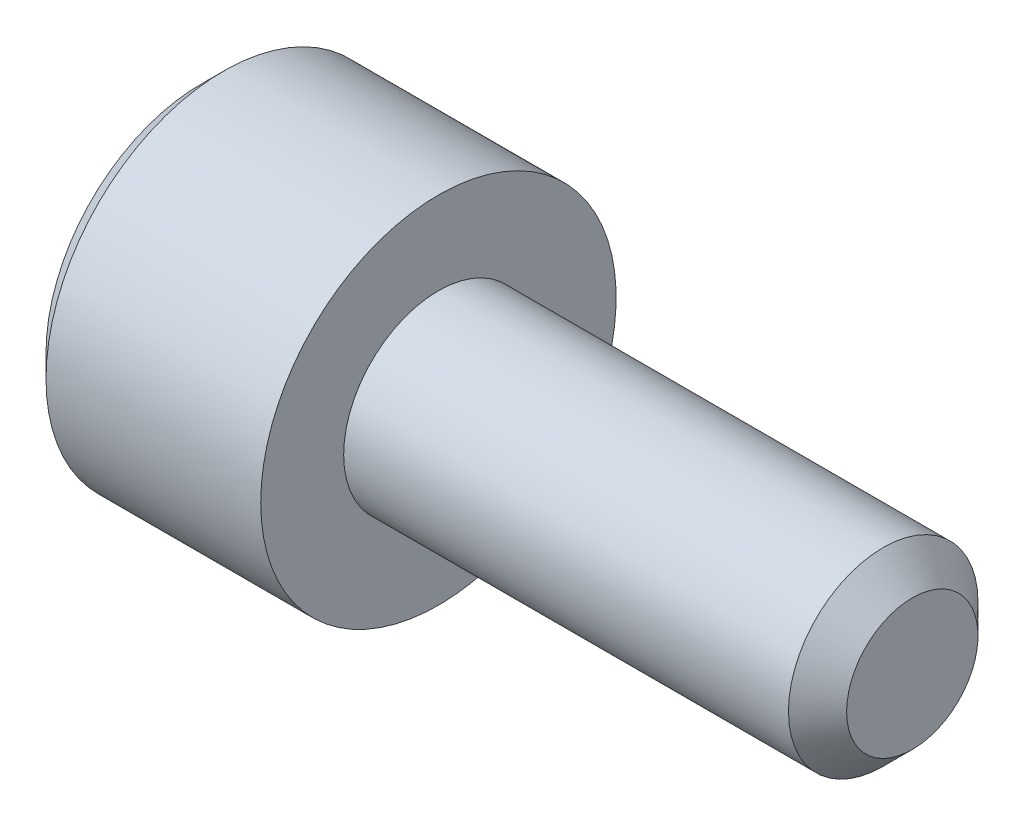
ISO-10303-21;
HEADER;
FILE_DESCRIPTION(('STEP AP214'),'2;1');
FILE_NAME('part.step','',(''),(''),'','','');
FILE_SCHEMA(('AUTOMOTIVE_DESIGN { 1 0 10303 214 1 1 1 1 }'));
ENDSEC;
DATA;
#1=APPLICATION_CONTEXT('core data for automotive mechanical design processes');
#2=APPLICATION_PROTOCOL_DEFINITION('international standard','automotive_design',2000,#1);
#3=PRODUCT_CONTEXT('',#1,'mechanical');
#4=PRODUCT('Part','Part','',(#3));
#5=PRODUCT_RELATED_PRODUCT_CATEGORY('part','',(#4));
#6=PRODUCT_DEFINITION_FORMATION('','',#4);
#7=PRODUCT_DEFINITION_CONTEXT('part definition',#1,'design');
#8=PRODUCT_DEFINITION('design','',#6,#7);
#9=PRODUCT_DEFINITION_SHAPE('','',#8);
#10=(LENGTH_UNIT() NAMED_UNIT(*) SI_UNIT(.MILLI.,.METRE.));
#11=(NAMED_UNIT(*) PLANE_ANGLE_UNIT() SI_UNIT($,.RADIAN.));
#12=(NAMED_UNIT(*) SI_UNIT($,.STERADIAN.) SOLID_ANGLE_UNIT());
#13=UNCERTAINTY_MEASURE_WITH_UNIT(LENGTH_MEASURE(1.E-05),#10,'distance_accuracy_value','');
#14=(GEOMETRIC_REPRESENTATION_CONTEXT(3) GLOBAL_UNCERTAINTY_ASSIGNED_CONTEXT((#13)) GLOBAL_UNIT_ASSIGNED_CONTEXT((#10,
#11,#12)) REPRESENTATION_CONTEXT('',''));
#15=CARTESIAN_POINT('',(0.,0.,0.));
#16=DIRECTION('',(0.,0.,1.));
#17=DIRECTION('',(1.,0.,0.));
#18=AXIS2_PLACEMENT_3D('',#15,#16,#17);
#19=CARTESIAN_POINT('',(-1.85,0.,0.));
#20=DIRECTION('',(-1.,0.,0.));
#21=DIRECTION('',(0.,0.,1.));
#22=AXIS2_PLACEMENT_3D('',#19,#20,#21);
#23=CONICAL_SURFACE('',#22,0.75,0.785398163397448);
#24=CARTESIAN_POINT('',(-2.,0.,0.));
#25=DIRECTION('',(-1.,0.,0.));
#26=DIRECTION('',(0.,0.,1.));
#27=AXIS2_PLACEMENT_3D('',#24,#25,#26);
#28=CIRCLE('',#27,0.9);
#29=CARTESIAN_POINT('',(-2.,0.,0.9));
#30=VERTEX_POINT('',#29);
#31=EDGE_CURVE('E226',#30,#30,#28,.T.);
#32=ORIENTED_EDGE('',*,*,#31,.T.);
#33=EDGE_LOOP('',(#32));
#34=FACE_BOUND('',#33,.T.);
#35=CARTESIAN_POINT('',(-1.96614089692921,0.866140873838278,-0.0002));
#36=CARTESIAN_POINT('',(-1.95125951424836,0.85125103201321,0.0255899625576815));
#37=CARTESIAN_POINT('',(-1.9372516693914,0.83611219228842,0.0518112021286592));
#38=CARTESIAN_POINT('',(-1.9116029284667,0.80524213589435,0.105279708235706));
#39=CARTESIAN_POINT('',(-1.89997631549011,0.789507978959821,0.132532067460573));
#40=CARTESIAN_POINT('',(-1.88005944955668,0.757780686272654,0.187485350381353));
#41=CARTESIAN_POINT('',(-1.87171909786581,0.741795643459148,0.21517225669551));
#42=CARTESIAN_POINT('',(-1.85886814574587,0.709473647943368,0.271155595130853));
#43=CARTESIAN_POINT('',(-1.85434794437328,0.693137683900543,0.299450314843645));
#44=CARTESIAN_POINT('',(-1.85027123688187,0.664986099540475,0.348210289268844));
#45=CARTESIAN_POINT('',(-1.84966820039852,0.653207128451651,0.368612065655573));
#46=CARTESIAN_POINT('',(-1.85067990979997,0.629671982217687,0.40937613469636));
#47=CARTESIAN_POINT('',(-1.85229514477447,0.617915812672248,0.429738417651455));
#48=CARTESIAN_POINT('',(-1.86036155075748,0.582815153286452,0.490534543086824));
#49=CARTESIAN_POINT('',(-1.87003433961216,0.559645329552699,0.530665854996099));
#50=CARTESIAN_POINT('',(-1.89338172175675,0.518974152327359,0.601110400354026));
#51=CARTESIAN_POINT('',(-1.90583396185669,0.501282308923486,0.631753572009086));
#52=CARTESIAN_POINT('',(-1.9338850140153,0.466591771248069,0.69183934580479));
#53=CARTESIAN_POINT('',(-1.94947358968819,0.449591032904757,0.721285488381591));
#54=CARTESIAN_POINT('',(-1.96614089692921,0.432897231838382,0.7502));
#55=B_SPLINE_CURVE_WITH_KNOTS('',3,(#35,#36,#37,#38,#39,#40,#41,#42,#43,#44,#45,#46,#47,#48,#49,
#50,#51,#52,#53,#54),.UNSPECIFIED.,.F.,.F.,(4,2,2,2,2,2,2,2,2,4),(0.,0.0999419466095598,
0.200466857654446,0.299393763705718,0.398071297300231,0.468665775681748,0.53927582139884,
0.680536257244566,0.792918418368074,0.904939568716032),.UNSPECIFIED.);
#56=CARTESIAN_POINT('',(-1.96602540378444,0.86602540378444,0.));
#57=VERTEX_POINT('',#56);
#58=CARTESIAN_POINT('',(-1.96602540378444,0.43301270189222,0.75));
#59=VERTEX_POINT('',#58);
#60=EDGE_CURVE('E54',#57,#59,#55,.T.);
#61=ORIENTED_EDGE('',*,*,#60,.T.);
#62=CARTESIAN_POINT('',(-2.28498450539523,-0.917435707843764,0.75));
#63=CARTESIAN_POINT('',(-2.2678667108574,-0.895322637488462,0.75));
#64=CARTESIAN_POINT('',(-2.25090072767686,-0.873092435797409,0.75));
#65=CARTESIAN_POINT('',(-2.21733662385259,-0.828348331249561,0.75));
#66=CARTESIAN_POINT('',(-2.20073858866413,-0.805834364354332,0.75));
#67=CARTESIAN_POINT('',(-2.15135585709605,-0.737463645985081,0.75));
#68=CARTESIAN_POINT('',(-2.11924462594972,-0.691112526673733,0.75));
#69=CARTESIAN_POINT('',(-2.05568682596992,-0.593551125551393,0.75));
#70=CARTESIAN_POINT('',(-2.02442165720724,-0.542221451270677,0.75));
#71=CARTESIAN_POINT('',(-1.96687568450647,-0.436934399168266,0.75));
#72=CARTESIAN_POINT('',(-1.94057804705966,-0.382986703868344,0.75));
#73=CARTESIAN_POINT('',(-1.90839074036174,-0.302507607984157,0.75));
#74=CARTESIAN_POINT('',(-1.89924982674428,-0.277284063785511,0.75));
#75=CARTESIAN_POINT('',(-1.88298812399052,-0.226180863902708,0.75));
#76=CARTESIAN_POINT('',(-1.87586746044888,-0.20030116753587,0.75));
#77=CARTESIAN_POINT('',(-1.86415365084109,-0.148504398457123,0.75));
#78=CARTESIAN_POINT('',(-1.85951333869583,-0.122598170477208,0.75));
#79=CARTESIAN_POINT('',(-1.85285693649874,-0.070440295072611,0.75));
#80=CARTESIAN_POINT('',(-1.85084110928875,-0.0441886133166744,0.75));
#81=CARTESIAN_POINT('',(-1.84961537614473,0.00715979592785976,0.75));
#82=CARTESIAN_POINT('',(-1.85027949049467,0.0322535332763837,0.75));
#83=CARTESIAN_POINT('',(-1.85408395670594,0.082242672718766,0.75));
#84=CARTESIAN_POINT('',(-1.85722369361662,0.107138122516666,0.75));
#85=CARTESIAN_POINT('',(-1.86585263917875,0.156986366361875,0.75));
#86=CARTESIAN_POINT('',(-1.87138423328569,0.181931702819942,0.75));
#87=CARTESIAN_POINT('',(-1.88448687025693,0.231269085182803,0.75));
#88=CARTESIAN_POINT('',(-1.89205781682589,0.255661157153014,0.75));
#89=CARTESIAN_POINT('',(-1.91810014054592,0.330191673605323,0.75));
#90=CARTESIAN_POINT('',(-1.93943977214851,0.379324631470661,0.75));
#91=CARTESIAN_POINT('',(-1.98693832469846,0.475298904003308,0.75));
#92=CARTESIAN_POINT('',(-2.01311412250561,0.522131443026563,0.75));
#93=CARTESIAN_POINT('',(-2.06717247921482,0.611659319459457,0.75));
#94=CARTESIAN_POINT('',(-2.09490758962535,0.654444829936083,0.75));
#95=CARTESIAN_POINT('',(-2.13780794830858,0.717480249811218,0.75));
#96=CARTESIAN_POINT('',(-2.15226421085697,0.738221190091019,0.75));
#97=CARTESIAN_POINT('',(-2.18156559351443,0.779418304292079,0.75));
#98=CARTESIAN_POINT('',(-2.19641060589534,0.799874554748216,0.75));
#99=CARTESIAN_POINT('',(-2.21141700400184,0.820212019409876,0.75));
#100=B_SPLINE_CURVE_WITH_KNOTS('',3,(#62,#63,#64,#65,#66,#67,#68,#69,#70,#71,#72,#73,#74,#75,
#76,#77,#78,#79,#80,#81,#82,#83,#84,#85,#86,#87,#88,#89,#90,#91,#92,#93,#94,#95,#96,#97,#98,
#99),.UNSPECIFIED.,.F.,.F.,(4,2,2,2,2,2,2,2,2,2,2,2,2,2,2,2,2,2,4),(0.,0.083891166922223,
0.167801617506669,0.336896584417538,0.517070724437731,0.696622901565622,0.77704232374542,
0.857466744334747,0.936301883451218,1.01514491728988,1.09032587205516,1.16548815756962,
1.24204077046884,1.31858976929581,1.47882432997554,1.63962900434597,1.79251782144892,
1.86836026980847,1.94418191901598),.UNSPECIFIED.);
#101=CARTESIAN_POINT('',(-1.96602540378444,-0.43301270189222,0.75));
#102=VERTEX_POINT('',#101);
#103=EDGE_CURVE('E196',#59,#102,#100,.F.);
#104=ORIENTED_EDGE('',*,*,#103,.T.);
#105=CARTESIAN_POINT('',(-1.96614089692921,-0.432897231838382,0.7502));
#106=CARTESIAN_POINT('',(-1.95125951424836,-0.44778707366345,0.724410037442319));
#107=CARTESIAN_POINT('',(-1.9372516693914,-0.462925913388239,0.698188797871341));
#108=CARTESIAN_POINT('',(-1.9116029284667,-0.49379596978231,0.644720291764294));
#109=CARTESIAN_POINT('',(-1.89997631549011,-0.509530126716839,0.617467932539428));
#110=CARTESIAN_POINT('',(-1.88005944955668,-0.541257419404005,0.562514649618648));
#111=CARTESIAN_POINT('',(-1.87171909786581,-0.557242462217511,0.534827743304491));
#112=CARTESIAN_POINT('',(-1.85886814574587,-0.589564457733291,0.478844404869148));
#113=CARTESIAN_POINT('',(-1.85434794437328,-0.605900421776116,0.450549685156356));
#114=CARTESIAN_POINT('',(-1.85027123688187,-0.634052006136184,0.401789710731158));
#115=CARTESIAN_POINT('',(-1.84966820039852,-0.645830977225008,0.381387934344429));
#116=CARTESIAN_POINT('',(-1.85067990979997,-0.669366123458972,0.340623865303642));
#117=CARTESIAN_POINT('',(-1.85229514477447,-0.681122293004411,0.320261582348547));
#118=CARTESIAN_POINT('',(-1.86036155075748,-0.716222952390207,0.259465456913178));
#119=CARTESIAN_POINT('',(-1.87003433961216,-0.73939277612396,0.219334145003903));
#120=CARTESIAN_POINT('',(-1.89338172175675,-0.7800639533493,0.148889599645976));
#121=CARTESIAN_POINT('',(-1.90583396185669,-0.797755796753174,0.118246427990915));
#122=CARTESIAN_POINT('',(-1.9338850140153,-0.83244633442859,0.0581606541952108));
#123=CARTESIAN_POINT('',(-1.94947358968819,-0.849447072771903,0.0287145116184096));
#124=CARTESIAN_POINT('',(-1.96614089692921,-0.866140873838278,-0.000199999999999989));
#125=B_SPLINE_CURVE_WITH_KNOTS('',3,(#105,#106,#107,#108,#109,#110,#111,#112,#113,#114,#115,
#116,#117,#118,#119,#120,#121,#122,#123,#124),.UNSPECIFIED.,.F.,.F.,(4,2,2,2,2,2,2,2,2,4),(0.,
0.0999419466095593,0.200466857654446,0.299393763705716,0.398071297300229,0.468665775681746,
0.539275821398837,0.680536257244564,0.792918418368073,0.904939568716032),.UNSPECIFIED.);
#126=CARTESIAN_POINT('',(-1.96602540378444,-0.86602540378444,0.));
#127=VERTEX_POINT('',#126);
#128=EDGE_CURVE('E140',#102,#127,#125,.T.);
#129=ORIENTED_EDGE('',*,*,#128,.T.);
#130=CARTESIAN_POINT('',(-1.96614089692921,-0.866140873838278,0.0002));
#131=CARTESIAN_POINT('',(-1.95125951424836,-0.85125103201321,-0.0255899625576815));
#132=CARTESIAN_POINT('',(-1.9372516693914,-0.83611219228842,-0.0518112021286592));
#133=CARTESIAN_POINT('',(-1.9116029284667,-0.80524213589435,-0.105279708235706));
#134=CARTESIAN_POINT('',(-1.89997631549011,-0.789507978959821,-0.132532067460573));
#135=CARTESIAN_POINT('',(-1.88005944955668,-0.757780686272654,-0.187485350381353));
#136=CARTESIAN_POINT('',(-1.87171909786581,-0.741795643459148,-0.21517225669551));
#137=CARTESIAN_POINT('',(-1.85886814574587,-0.709473647943368,-0.271155595130853));
#138=CARTESIAN_POINT('',(-1.85434794437328,-0.693137683900543,-0.299450314843645));
#139=CARTESIAN_POINT('',(-1.85027123688187,-0.664986099540475,-0.348210289268844));
#140=CARTESIAN_POINT('',(-1.84966820039852,-0.653207128451651,-0.368612065655573));
#141=CARTESIAN_POINT('',(-1.85067990979997,-0.629671982217687,-0.40937613469636));
#142=CARTESIAN_POINT('',(-1.85229514477447,-0.617915812672248,-0.429738417651455));
#143=CARTESIAN_POINT('',(-1.86036155075748,-0.582815153286452,-0.490534543086824));
#144=CARTESIAN_POINT('',(-1.87003433961216,-0.559645329552699,-0.530665854996099));
#145=CARTESIAN_POINT('',(-1.89338172175675,-0.518974152327359,-0.601110400354026));
#146=CARTESIAN_POINT('',(-1.90583396185669,-0.501282308923486,-0.631753572009086));
#147=CARTESIAN_POINT('',(-1.9338850140153,-0.466591771248069,-0.69183934580479));
#148=CARTESIAN_POINT('',(-1.94947358968819,-0.449591032904757,-0.721285488381591));
#149=CARTESIAN_POINT('',(-1.96614089692921,-0.432897231838382,-0.7502));
#150=B_SPLINE_CURVE_WITH_KNOTS('',3,(#130,#131,#132,#133,#134,#135,#136,#137,#138,#139,#140,
#141,#142,#143,#144,#145,#146,#147,#148,#149),.UNSPECIFIED.,.F.,.F.,(4,2,2,2,2,2,2,2,2,4),(0.,
0.0999419466095598,0.200466857654446,0.299393763705718,0.398071297300231,0.468665775681748,
0.53927582139884,0.680536257244566,0.792918418368074,0.904939568716032),.UNSPECIFIED.);
#151=CARTESIAN_POINT('',(-1.96602540378444,-0.43301270189222,-0.75));
#152=VERTEX_POINT('',#151);
#153=EDGE_CURVE('E187',#127,#152,#150,.T.);
#154=ORIENTED_EDGE('',*,*,#153,.T.);
#155=CARTESIAN_POINT('',(-2.28498450539523,-0.917435707843764,-0.75));
#156=CARTESIAN_POINT('',(-2.2678667108574,-0.895322637488462,-0.75));
#157=CARTESIAN_POINT('',(-2.25090072767686,-0.873092435797409,-0.75));
#158=CARTESIAN_POINT('',(-2.21733662385259,-0.828348331249561,-0.75));
#159=CARTESIAN_POINT('',(-2.20073858866413,-0.805834364354332,-0.75));
#160=CARTESIAN_POINT('',(-2.15135585709605,-0.737463645985081,-0.75));
#161=CARTESIAN_POINT('',(-2.11924462594972,-0.691112526673733,-0.75));
#162=CARTESIAN_POINT('',(-2.05568682596992,-0.593551125551393,-0.75));
#163=CARTESIAN_POINT('',(-2.02442165720724,-0.542221451270677,-0.75));
#164=CARTESIAN_POINT('',(-1.96687568450647,-0.436934399168266,-0.75));
#165=CARTESIAN_POINT('',(-1.94057804705966,-0.382986703868344,-0.75));
#166=CARTESIAN_POINT('',(-1.90839074036174,-0.302507607984157,-0.75));
#167=CARTESIAN_POINT('',(-1.89924982674428,-0.277284063785511,-0.75));
#168=CARTESIAN_POINT('',(-1.88298812399052,-0.226180863902708,-0.75));
#169=CARTESIAN_POINT('',(-1.87586746044888,-0.20030116753587,-0.75));
#170=CARTESIAN_POINT('',(-1.86415365084109,-0.148504398457123,-0.75));
#171=CARTESIAN_POINT('',(-1.85951333869583,-0.122598170477208,-0.75));
#172=CARTESIAN_POINT('',(-1.85285693649874,-0.070440295072611,-0.75));
#173=CARTESIAN_POINT('',(-1.85084110928875,-0.0441886133166744,-0.75));
#174=CARTESIAN_POINT('',(-1.84961537614473,0.00715979592785976,-0.75));
#175=CARTESIAN_POINT('',(-1.85027949049467,0.0322535332763837,-0.75));
#176=CARTESIAN_POINT('',(-1.85408395670594,0.082242672718766,-0.75));
#177=CARTESIAN_POINT('',(-1.85722369361662,0.107138122516666,-0.75));
#178=CARTESIAN_POINT('',(-1.86585263917875,0.156986366361875,-0.75));
#179=CARTESIAN_POINT('',(-1.87138423328569,0.181931702819942,-0.75));
#180=CARTESIAN_POINT('',(-1.88448687025693,0.231269085182803,-0.75));
#181=CARTESIAN_POINT('',(-1.89205781682589,0.255661157153014,-0.75));
#182=CARTESIAN_POINT('',(-1.91810014054592,0.330191673605323,-0.75));
#183=CARTESIAN_POINT('',(-1.93943977214851,0.379324631470661,-0.75));
#184=CARTESIAN_POINT('',(-1.98693832469846,0.475298904003308,-0.75));
#185=CARTESIAN_POINT('',(-2.01311412250561,0.522131443026563,-0.75));
#186=CARTESIAN_POINT('',(-2.06717247921482,0.611659319459457,-0.75));
#187=CARTESIAN_POINT('',(-2.09490758962535,0.654444829936083,-0.75));
#188=CARTESIAN_POINT('',(-2.13780794830858,0.717480249811218,-0.75));
#189=CARTESIAN_POINT('',(-2.15226421085697,0.738221190091019,-0.75));
#190=CARTESIAN_POINT('',(-2.18156559351443,0.779418304292079,-0.75));
#191=CARTESIAN_POINT('',(-2.19641060589534,0.799874554748216,-0.75));
#192=CARTESIAN_POINT('',(-2.21141700400184,0.820212019409876,-0.75));
#193=B_SPLINE_CURVE_WITH_KNOTS('',3,(#155,#156,#157,#158,#159,#160,#161,#162,#163,#164,#165,
#166,#167,#168,#169,#170,#171,#172,#173,#174,#175,#176,#177,#178,#179,#180,#181,#182,#183,#184,
#185,#186,#187,#188,#189,#190,#191,#192),.UNSPECIFIED.,.F.,.F.,(4,2,2,2,2,2,2,2,2,2,2,2,2,2,2,2,
2,2,4),(0.,0.083891166922223,0.167801617506669,0.336896584417538,0.517070724437731,
0.696622901565622,0.77704232374542,0.857466744334747,0.936301883451218,1.01514491728988,
1.09032587205516,1.16548815756962,1.24204077046884,1.31858976929581,1.47882432997554,
1.63962900434597,1.79251782144892,1.86836026980847,1.94418191901598),.UNSPECIFIED.);
#194=CARTESIAN_POINT('',(-1.96602540378444,0.43301270189222,-0.75));
#195=VERTEX_POINT('',#194);
#196=EDGE_CURVE('E182',#152,#195,#193,.T.);
#197=ORIENTED_EDGE('',*,*,#196,.T.);
#198=CARTESIAN_POINT('',(-1.96614089692921,0.432897231838382,-0.7502));
#199=CARTESIAN_POINT('',(-1.95125951424836,0.44778707366345,-0.724410037442319));
#200=CARTESIAN_POINT('',(-1.9372516693914,0.462925913388239,-0.698188797871341));
#201=CARTESIAN_POINT('',(-1.9116029284667,0.49379596978231,-0.644720291764294));
#202=CARTESIAN_POINT('',(-1.89997631549011,0.509530126716839,-0.617467932539428));
#203=CARTESIAN_POINT('',(-1.88005944955668,0.541257419404005,-0.562514649618648));
#204=CARTESIAN_POINT('',(-1.87171909786581,0.557242462217511,-0.534827743304491));
#205=CARTESIAN_POINT('',(-1.85886814574587,0.589564457733291,-0.478844404869148));
#206=CARTESIAN_POINT('',(-1.85434794437328,0.605900421776116,-0.450549685156356));
#207=CARTESIAN_POINT('',(-1.85027123688187,0.634052006136184,-0.401789710731158));
#208=CARTESIAN_POINT('',(-1.84966820039852,0.645830977225008,-0.381387934344429));
#209=CARTESIAN_POINT('',(-1.85067990979997,0.669366123458972,-0.340623865303642));
#210=CARTESIAN_POINT('',(-1.85229514477447,0.681122293004411,-0.320261582348547));
#211=CARTESIAN_POINT('',(-1.86036155075748,0.716222952390207,-0.259465456913178));
#212=CARTESIAN_POINT('',(-1.87003433961216,0.73939277612396,-0.219334145003903));
#213=CARTESIAN_POINT('',(-1.89338172175675,0.7800639533493,-0.148889599645976));
#214=CARTESIAN_POINT('',(-1.90583396185669,0.797755796753174,-0.118246427990915));
#215=CARTESIAN_POINT('',(-1.9338850140153,0.83244633442859,-0.0581606541952108));
#216=CARTESIAN_POINT('',(-1.94947358968819,0.849447072771903,-0.0287145116184096));
#217=CARTESIAN_POINT('',(-1.96614089692921,0.866140873838278,0.000199999999999989));
#218=B_SPLINE_CURVE_WITH_KNOTS('',3,(#198,#199,#200,#201,#202,#203,#204,#205,#206,#207,#208,
#209,#210,#211,#212,#213,#214,#215,#216,#217),.UNSPECIFIED.,.F.,.F.,(4,2,2,2,2,2,2,2,2,4),(0.,
0.0999419466095593,0.200466857654446,0.299393763705716,0.398071297300229,0.468665775681746,
0.539275821398837,0.680536257244564,0.792918418368073,0.904939568716032),.UNSPECIFIED.);
#219=EDGE_CURVE('E143',#195,#57,#218,.T.);
#220=ORIENTED_EDGE('',*,*,#219,.T.);
#221=EDGE_LOOP('',(#61,#104,#129,#154,#197,#220));
#222=FACE_BOUND('',#221,.T.);
#223=ADVANCED_FACE('F39',(#34,#222),#23,.F.);
#224=CARTESIAN_POINT('',(-2.,0.,0.));
#225=DIRECTION('',(1.,0.,0.));
#226=DIRECTION('',(0.,0.,-1.));
#227=AXIS2_PLACEMENT_3D('',#224,#225,#226);
#228=PLANE('',#227);
#229=CARTESIAN_POINT('',(-2.,0.,0.));
#230=DIRECTION('',(-1.,0.,0.));
#231=DIRECTION('',(0.,0.,1.));
#232=AXIS2_PLACEMENT_3D('',#229,#230,#231);
#233=CIRCLE('',#232,1.3125);
#234=CARTESIAN_POINT('',(-2.,0.,1.3125));
#235=VERTEX_POINT('',#234);
#236=EDGE_CURVE('E11',#235,#235,#233,.T.);
#237=ORIENTED_EDGE('',*,*,#236,.T.);
#238=EDGE_LOOP('',(#237));
#239=FACE_BOUND('',#238,.T.);
#240=ORIENTED_EDGE('',*,*,#31,.F.);
#241=EDGE_LOOP('',(#240));
#242=FACE_BOUND('',#241,.T.);
#243=ADVANCED_FACE('F41',(#239,#242),#228,.F.);
#244=CARTESIAN_POINT('',(-1.8125,0.,0.));
#245=DIRECTION('',(1.,0.,0.));
#246=DIRECTION('',(0.,0.,-1.));
#247=AXIS2_PLACEMENT_3D('',#244,#245,#246);
#248=CONICAL_SURFACE('',#247,1.5,0.785398163397448);
#249=ORIENTED_EDGE('',*,*,#236,.F.);
#250=EDGE_LOOP('',(#249));
#251=FACE_BOUND('',#250,.T.);
#252=CARTESIAN_POINT('',(-1.8125,0.,0.));
#253=DIRECTION('',(-1.,0.,0.));
#254=DIRECTION('',(0.,0.,1.));
#255=AXIS2_PLACEMENT_3D('',#252,#253,#254);
#256=CIRCLE('',#255,1.5);
#257=CARTESIAN_POINT('',(-1.8125,0.,1.5));
#258=VERTEX_POINT('',#257);
#259=EDGE_CURVE('E47',#258,#258,#256,.T.);
#260=ORIENTED_EDGE('',*,*,#259,.T.);
#261=EDGE_LOOP('',(#260));
#262=FACE_BOUND('',#261,.T.);
#263=ADVANCED_FACE('F222',(#251,#262),#248,.T.);
#264=CARTESIAN_POINT('',(4.,0.,0.));
#265=DIRECTION('',(-1.,0.,0.));
#266=DIRECTION('',(0.,0.,1.));
#267=AXIS2_PLACEMENT_3D('',#264,#265,#266);
#268=CYLINDRICAL_SURFACE('',#267,1.5);
#269=ORIENTED_EDGE('',*,*,#259,.F.);
#270=EDGE_LOOP('',(#269));
#271=FACE_BOUND('',#270,.T.);
#272=CARTESIAN_POINT('',(0.,0.,0.));
#273=DIRECTION('',(-1.,0.,0.));
#274=DIRECTION('',(0.,0.,1.));
#275=AXIS2_PLACEMENT_3D('',#272,#273,#274);
#276=CIRCLE('',#275,1.5);
#277=CARTESIAN_POINT('',(0.,0.,1.5));
#278=VERTEX_POINT('',#277);
#279=EDGE_CURVE('E241',#278,#278,#276,.T.);
#280=ORIENTED_EDGE('',*,*,#279,.T.);
#281=EDGE_LOOP('',(#280));
#282=FACE_BOUND('',#281,.T.);
#283=ADVANCED_FACE('F247',(#271,#282),#268,.T.);
#284=CARTESIAN_POINT('',(0.,1.5,0.));
#285=DIRECTION('',(-1.,0.,0.));
#286=DIRECTION('',(0.,0.,1.));
#287=AXIS2_PLACEMENT_3D('',#284,#285,#286);
#288=PLANE('',#287);
#289=ORIENTED_EDGE('',*,*,#279,.F.);
#290=EDGE_LOOP('',(#289));
#291=FACE_BOUND('',#290,.T.);
#292=CARTESIAN_POINT('',(0.,0.,0.));
#293=DIRECTION('',(-1.,0.,0.));
#294=DIRECTION('',(0.,0.,1.));
#295=AXIS2_PLACEMENT_3D('',#292,#293,#294);
#296=CIRCLE('',#295,0.8);
#297=CARTESIAN_POINT('',(0.,0.,0.8));
#298=VERTEX_POINT('',#297);
#299=EDGE_CURVE('E238',#298,#298,#296,.T.);
#300=ORIENTED_EDGE('',*,*,#299,.T.);
#301=EDGE_LOOP('',(#300));
#302=FACE_BOUND('',#301,.T.);
#303=ADVANCED_FACE('F250',(#291,#302),#288,.F.);
#304=CARTESIAN_POINT('',(4.,0.,0.));
#305=DIRECTION('',(-1.,0.,0.));
#306=DIRECTION('',(0.,0.,1.));
#307=AXIS2_PLACEMENT_3D('',#304,#305,#306);
#308=CYLINDRICAL_SURFACE('',#307,0.8);
#309=ORIENTED_EDGE('',*,*,#299,.F.);
#310=EDGE_LOOP('',(#309));
#311=FACE_BOUND('',#310,.T.);
#312=CARTESIAN_POINT('',(3.7545,0.,0.));
#313=DIRECTION('',(-1.,0.,0.));
#314=DIRECTION('',(0.,0.,1.));
#315=AXIS2_PLACEMENT_3D('',#312,#313,#314);
#316=CIRCLE('',#315,0.8);
#317=CARTESIAN_POINT('',(3.7545,0.,0.8));
#318=VERTEX_POINT('',#317);
#319=EDGE_CURVE('E232',#318,#318,#316,.T.);
#320=ORIENTED_EDGE('',*,*,#319,.T.);
#321=EDGE_LOOP('',(#320));
#322=FACE_BOUND('',#321,.T.);
#323=ADVANCED_FACE('F256',(#311,#322),#308,.T.);
#324=CARTESIAN_POINT('',(4.,0.,0.));
#325=DIRECTION('',(-1.,0.,0.));
#326=DIRECTION('',(0.,0.,1.));
#327=AXIS2_PLACEMENT_3D('',#324,#325,#326);
#328=CONICAL_SURFACE('',#327,0.554500000000001,0.785398163397448);
#329=ORIENTED_EDGE('',*,*,#319,.F.);
#330=EDGE_LOOP('',(#329));
#331=FACE_BOUND('',#330,.T.);
#332=CARTESIAN_POINT('',(4.,0.,0.));
#333=DIRECTION('',(-1.,0.,0.));
#334=DIRECTION('',(0.,0.,1.));
#335=AXIS2_PLACEMENT_3D('',#332,#333,#334);
#336=CIRCLE('',#335,0.554500000000001);
#337=CARTESIAN_POINT('',(4.,0.,0.554500000000001));
#338=VERTEX_POINT('',#337);
#339=EDGE_CURVE('E228',#338,#338,#336,.T.);
#340=ORIENTED_EDGE('',*,*,#339,.T.);
#341=EDGE_LOOP('',(#340));
#342=FACE_BOUND('',#341,.T.);
#343=ADVANCED_FACE('F262',(#331,#342),#328,.T.);
#344=CARTESIAN_POINT('',(4.,0.554500000000001,0.));
#345=DIRECTION('',(-1.,0.,0.));
#346=DIRECTION('',(0.,0.,1.));
#347=AXIS2_PLACEMENT_3D('',#344,#345,#346);
#348=PLANE('',#347);
#349=ORIENTED_EDGE('',*,*,#339,.F.);
#350=EDGE_LOOP('',(#349));
#351=FACE_BOUND('',#350,.T.);
#352=ADVANCED_FACE('F206',(#351),#348,.F.);
#353=CARTESIAN_POINT('',(-1.,0.43301270189222,0.75));
#354=DIRECTION('',(0.,0.,-1.));
#355=DIRECTION('',(-1.,0.,0.));
#356=AXIS2_PLACEMENT_3D('',#353,#354,#355);
#357=PLANE('',#356);
#358=DIRECTION('',(-1.,0.,0.));
#359=VECTOR('',#358,1.);
#360=CARTESIAN_POINT('',(-1.,0.43301270189222,0.75));
#361=LINE('',#360,#359);
#362=CARTESIAN_POINT('',(-1.,0.43301270189222,0.75));
#363=VERTEX_POINT('',#362);
#364=EDGE_CURVE('E426',#363,#59,#361,.T.);
#365=ORIENTED_EDGE('',*,*,#364,.F.);
#366=DIRECTION('',(0.,-1.,0.));
#367=VECTOR('',#366,1.);
#368=CARTESIAN_POINT('',(-1.,0.43301270189222,0.75));
#369=LINE('',#368,#367);
#370=CARTESIAN_POINT('',(-1.,0.,0.75));
#371=VERTEX_POINT('',#370);
#372=EDGE_CURVE('E123',#363,#371,#369,.T.);
#373=ORIENTED_EDGE('',*,*,#372,.T.);
#374=CARTESIAN_POINT('',(-1.,-0.43301270189222,0.75));
#375=VERTEX_POINT('',#374);
#376=EDGE_CURVE('E115',#371,#375,#369,.T.);
#377=ORIENTED_EDGE('',*,*,#376,.T.);
#378=DIRECTION('',(-1.,0.,0.));
#379=VECTOR('',#378,1.);
#380=CARTESIAN_POINT('',(-1.,-0.43301270189222,0.75));
#381=LINE('',#380,#379);
#382=EDGE_CURVE('E121',#375,#102,#381,.T.);
#383=ORIENTED_EDGE('',*,*,#382,.T.);
#384=ORIENTED_EDGE('',*,*,#103,.F.);
#385=EDGE_LOOP('',(#365,#373,#377,#383,#384));
#386=FACE_BOUND('',#385,.T.);
#387=ADVANCED_FACE('F118',(#386),#357,.T.);
#388=CARTESIAN_POINT('',(-1.,-0.43301270189222,0.75));
#389=DIRECTION('',(0.,0.866025403784438,-0.500000000000001));
#390=DIRECTION('',(0.,0.500000000000001,0.866025403784438));
#391=AXIS2_PLACEMENT_3D('',#388,#389,#390);
#392=PLANE('',#391);
#393=ORIENTED_EDGE('',*,*,#382,.F.);
#394=DIRECTION('',(0.,-0.500000000000001,-0.866025403784438));
#395=VECTOR('',#394,1.);
#396=CARTESIAN_POINT('',(-1.,-0.43301270189222,0.75));
#397=LINE('',#396,#395);
#398=CARTESIAN_POINT('',(-1.,-0.64951905283833,0.375000000000001));
#399=VERTEX_POINT('',#398);
#400=EDGE_CURVE('E128',#375,#399,#397,.T.);
#401=ORIENTED_EDGE('',*,*,#400,.T.);
#402=CARTESIAN_POINT('',(-1.,-0.86602540378444,0.));
#403=VERTEX_POINT('',#402);
#404=EDGE_CURVE('E135',#399,#403,#397,.T.);
#405=ORIENTED_EDGE('',*,*,#404,.T.);
#406=DIRECTION('',(-1.,0.,0.));
#407=VECTOR('',#406,1.);
#408=CARTESIAN_POINT('',(-1.,-0.86602540378444,0.));
#409=LINE('',#408,#407);
#410=EDGE_CURVE('E141',#403,#127,#409,.T.);
#411=ORIENTED_EDGE('',*,*,#410,.T.);
#412=ORIENTED_EDGE('',*,*,#128,.F.);
#413=EDGE_LOOP('',(#393,#401,#405,#411,#412));
#414=FACE_BOUND('',#413,.T.);
#415=ADVANCED_FACE('F138',(#414),#392,.T.);
#416=CARTESIAN_POINT('',(-1.,-0.86602540378444,0.));
#417=DIRECTION('',(0.,0.866025403784438,0.500000000000001));
#418=DIRECTION('',(0.,-0.500000000000001,0.866025403784438));
#419=AXIS2_PLACEMENT_3D('',#416,#417,#418);
#420=PLANE('',#419);
#421=ORIENTED_EDGE('',*,*,#410,.F.);
#422=DIRECTION('',(0.,0.500000000000001,-0.866025403784438));
#423=VECTOR('',#422,1.);
#424=CARTESIAN_POINT('',(-1.,-0.86602540378444,0.));
#425=LINE('',#424,#423);
#426=CARTESIAN_POINT('',(-1.,-0.649519052838329,-0.375));
#427=VERTEX_POINT('',#426);
#428=EDGE_CURVE('E62',#403,#427,#425,.T.);
#429=ORIENTED_EDGE('',*,*,#428,.T.);
#430=CARTESIAN_POINT('',(-1.,-0.43301270189222,-0.75));
#431=VERTEX_POINT('',#430);
#432=EDGE_CURVE('E134',#427,#431,#425,.T.);
#433=ORIENTED_EDGE('',*,*,#432,.T.);
#434=DIRECTION('',(-1.,0.,0.));
#435=VECTOR('',#434,1.);
#436=CARTESIAN_POINT('',(-1.,-0.43301270189222,-0.75));
#437=LINE('',#436,#435);
#438=EDGE_CURVE('E145',#431,#152,#437,.T.);
#439=ORIENTED_EDGE('',*,*,#438,.T.);
#440=ORIENTED_EDGE('',*,*,#153,.F.);
#441=EDGE_LOOP('',(#421,#429,#433,#439,#440));
#442=FACE_BOUND('',#441,.T.);
#443=ADVANCED_FACE('F178',(#442),#420,.T.);
#444=CARTESIAN_POINT('',(-1.,-0.43301270189222,-0.75));
#445=DIRECTION('',(0.,0.,1.));
#446=DIRECTION('',(1.,0.,0.));
#447=AXIS2_PLACEMENT_3D('',#444,#445,#446);
#448=PLANE('',#447);
#449=ORIENTED_EDGE('',*,*,#438,.F.);
#450=DIRECTION('',(0.,1.,0.));
#451=VECTOR('',#450,1.);
#452=CARTESIAN_POINT('',(-1.,-0.43301270189222,-0.75));
#453=LINE('',#452,#451);
#454=CARTESIAN_POINT('',(-1.,0.,-0.75));
#455=VERTEX_POINT('',#454);
#456=EDGE_CURVE('E439',#431,#455,#453,.T.);
#457=ORIENTED_EDGE('',*,*,#456,.T.);
#458=CARTESIAN_POINT('',(-1.,0.43301270189222,-0.75));
#459=VERTEX_POINT('',#458);
#460=EDGE_CURVE('E440',#455,#459,#453,.T.);
#461=ORIENTED_EDGE('',*,*,#460,.T.);
#462=DIRECTION('',(-1.,0.,0.));
#463=VECTOR('',#462,1.);
#464=CARTESIAN_POINT('',(-1.,0.43301270189222,-0.75));
#465=LINE('',#464,#463);
#466=EDGE_CURVE('E432',#459,#195,#465,.T.);
#467=ORIENTED_EDGE('',*,*,#466,.T.);
#468=ORIENTED_EDGE('',*,*,#196,.F.);
#469=EDGE_LOOP('',(#449,#457,#461,#467,#468));
#470=FACE_BOUND('',#469,.T.);
#471=ADVANCED_FACE('F173',(#470),#448,.T.);
#472=CARTESIAN_POINT('',(-1.,0.43301270189222,-0.75));
#473=DIRECTION('',(0.,-0.866025403784438,0.500000000000001));
#474=DIRECTION('',(0.,-0.500000000000001,-0.866025403784438));
#475=AXIS2_PLACEMENT_3D('',#472,#473,#474);
#476=PLANE('',#475);
#477=ORIENTED_EDGE('',*,*,#466,.F.);
#478=DIRECTION('',(0.,0.500000000000001,0.866025403784438));
#479=VECTOR('',#478,1.);
#480=CARTESIAN_POINT('',(-1.,0.43301270189222,-0.75));
#481=LINE('',#480,#479);
#482=CARTESIAN_POINT('',(-1.,0.64951905283833,-0.375000000000001));
#483=VERTEX_POINT('',#482);
#484=EDGE_CURVE('E421',#459,#483,#481,.T.);
#485=ORIENTED_EDGE('',*,*,#484,.T.);
#486=CARTESIAN_POINT('',(-1.,0.86602540378444,0.));
#487=VERTEX_POINT('',#486);
#488=EDGE_CURVE('E418',#483,#487,#481,.T.);
#489=ORIENTED_EDGE('',*,*,#488,.T.);
#490=DIRECTION('',(-1.,0.,0.));
#491=VECTOR('',#490,1.);
#492=CARTESIAN_POINT('',(-1.,0.86602540378444,0.));
#493=LINE('',#492,#491);
#494=EDGE_CURVE('E425',#487,#57,#493,.T.);
#495=ORIENTED_EDGE('',*,*,#494,.T.);
#496=ORIENTED_EDGE('',*,*,#219,.F.);
#497=EDGE_LOOP('',(#477,#485,#489,#495,#496));
#498=FACE_BOUND('',#497,.T.);
#499=ADVANCED_FACE('F167',(#498),#476,.T.);
#500=CARTESIAN_POINT('',(-1.,0.86602540378444,0.));
#501=DIRECTION('',(0.,-0.866025403784438,-0.500000000000001));
#502=DIRECTION('',(0.,0.500000000000001,-0.866025403784438));
#503=AXIS2_PLACEMENT_3D('',#500,#501,#502);
#504=PLANE('',#503);
#505=ORIENTED_EDGE('',*,*,#494,.F.);
#506=DIRECTION('',(0.,-0.500000000000001,0.866025403784438));
#507=VECTOR('',#506,1.);
#508=CARTESIAN_POINT('',(-1.,0.86602540378444,0.));
#509=LINE('',#508,#507);
#510=CARTESIAN_POINT('',(-1.,0.64951905283833,0.375000000000001));
#511=VERTEX_POINT('',#510);
#512=EDGE_CURVE('E417',#487,#511,#509,.T.);
#513=ORIENTED_EDGE('',*,*,#512,.T.);
#514=EDGE_CURVE('E420',#511,#363,#509,.T.);
#515=ORIENTED_EDGE('',*,*,#514,.T.);
#516=ORIENTED_EDGE('',*,*,#364,.T.);
#517=ORIENTED_EDGE('',*,*,#60,.F.);
#518=EDGE_LOOP('',(#505,#513,#515,#516,#517));
#519=FACE_BOUND('',#518,.T.);
#520=ADVANCED_FACE('F162',(#519),#504,.T.);
#521=CARTESIAN_POINT('',(-1.,0.,0.));
#522=DIRECTION('',(1.,0.,0.));
#523=DIRECTION('',(0.,0.,-1.));
#524=AXIS2_PLACEMENT_3D('',#521,#522,#523);
#525=PLANE('',#524);
#526=CARTESIAN_POINT('',(-1.,0.,0.));
#527=DIRECTION('',(-1.,0.,0.));
#528=DIRECTION('',(0.,0.,1.));
#529=AXIS2_PLACEMENT_3D('',#526,#527,#528);
#530=CIRCLE('',#529,0.75);
#531=EDGE_CURVE('E410',#483,#455,#530,.T.);
#532=ORIENTED_EDGE('',*,*,#531,.F.);
#533=ORIENTED_EDGE('',*,*,#484,.F.);
#534=ORIENTED_EDGE('',*,*,#460,.F.);
#535=EDGE_LOOP('',(#532,#533,#534));
#536=FACE_BOUND('',#535,.T.);
#537=ADVANCED_FACE('F166',(#536),#525,.F.);
#538=EDGE_CURVE('E234',#511,#483,#530,.T.);
#539=ORIENTED_EDGE('',*,*,#538,.F.);
#540=ORIENTED_EDGE('',*,*,#512,.F.);
#541=ORIENTED_EDGE('',*,*,#488,.F.);
#542=EDGE_LOOP('',(#539,#540,#541));
#543=FACE_BOUND('',#542,.T.);
#544=ADVANCED_FACE('F359',(#543),#525,.F.);
#545=EDGE_CURVE('E229',#371,#511,#530,.T.);
#546=ORIENTED_EDGE('',*,*,#545,.F.);
#547=ORIENTED_EDGE('',*,*,#372,.F.);
#548=ORIENTED_EDGE('',*,*,#514,.F.);
#549=EDGE_LOOP('',(#546,#547,#548));
#550=FACE_BOUND('',#549,.T.);
#551=ADVANCED_FACE('F368',(#550),#525,.F.);
#552=EDGE_CURVE('E130',#399,#371,#530,.T.);
#553=ORIENTED_EDGE('',*,*,#552,.F.);
#554=ORIENTED_EDGE('',*,*,#400,.F.);
#555=ORIENTED_EDGE('',*,*,#376,.F.);
#556=EDGE_LOOP('',(#553,#554,#555));
#557=FACE_BOUND('',#556,.T.);
#558=ADVANCED_FACE('F129',(#557),#525,.F.);
#559=EDGE_CURVE('E405',#427,#399,#530,.T.);
#560=ORIENTED_EDGE('',*,*,#559,.F.);
#561=ORIENTED_EDGE('',*,*,#428,.F.);
#562=ORIENTED_EDGE('',*,*,#404,.F.);
#563=EDGE_LOOP('',(#560,#561,#562));
#564=FACE_BOUND('',#563,.T.);
#565=ADVANCED_FACE('F213',(#564),#525,.F.);
#566=EDGE_CURVE('E407',#455,#427,#530,.T.);
#567=ORIENTED_EDGE('',*,*,#566,.F.);
#568=ORIENTED_EDGE('',*,*,#456,.F.);
#569=ORIENTED_EDGE('',*,*,#432,.F.);
#570=EDGE_LOOP('',(#567,#568,#569));
#571=FACE_BOUND('',#570,.T.);
#572=ADVANCED_FACE('F169',(#571),#525,.F.);
#573=CARTESIAN_POINT('',(-0.6,0.,0.));
#574=DIRECTION('',(-1.,0.,0.));
#575=DIRECTION('',(0.,0.,1.));
#576=AXIS2_PLACEMENT_3D('',#573,#574,#575);
#577=CONICAL_SURFACE('',#576,0.,1.08083900054117);
#578=ORIENTED_EDGE('',*,*,#545,.T.);
#579=ORIENTED_EDGE('',*,*,#538,.T.);
#580=ORIENTED_EDGE('',*,*,#531,.T.);
#581=ORIENTED_EDGE('',*,*,#566,.T.);
#582=ORIENTED_EDGE('',*,*,#559,.T.);
#583=ORIENTED_EDGE('',*,*,#552,.T.);
#584=EDGE_LOOP('',(#578,#579,#580,#581,#582,#583));
#585=FACE_BOUND('',#584,.T.);
#586=CARTESIAN_POINT('',(-0.6,0.,0.));
#587=VERTEX_POINT('',#586);
#588=VERTEX_LOOP('',#587);
#589=FACE_BOUND('',#588,.T.);
#590=ADVANCED_FACE('F207',(#585,#589),#577,.F.);
#591=CLOSED_SHELL('',(#223,#243,#263,#283,#303,#323,#343,#352,#387,#415,#443,#471,#499,#520,
#537,#544,#551,#558,#565,#572,#590));
#592=MANIFOLD_SOLID_BREP('B2',#591);
#593=ADVANCED_BREP_SHAPE_REPRESENTATION('',(#18,#592),#14);
#594=SHAPE_DEFINITION_REPRESENTATION(#9,#593);
ENDSEC;
END-ISO-10303-21;
